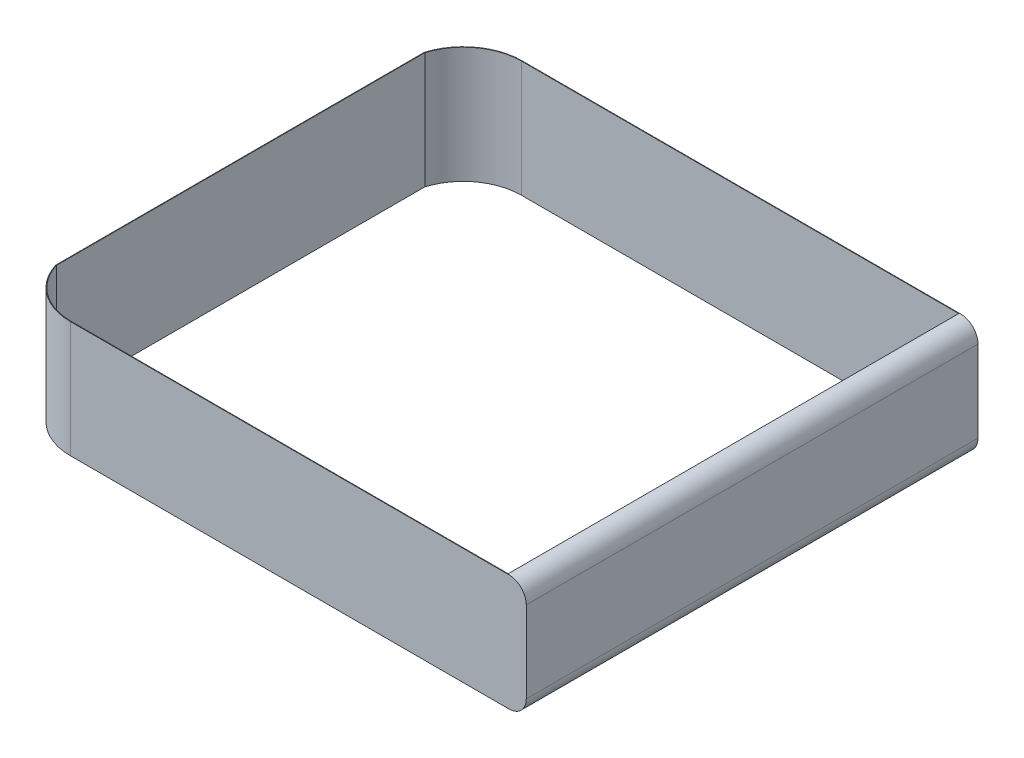
ISO-10303-21;
HEADER;
FILE_DESCRIPTION(('STEP AP214'),'2;1');
FILE_NAME('part.step','',(''),(''),'','','');
FILE_SCHEMA(('AUTOMOTIVE_DESIGN { 1 0 10303 214 1 1 1 1 }'));
ENDSEC;
DATA;
#1=APPLICATION_CONTEXT('core data for automotive mechanical design processes');
#2=APPLICATION_PROTOCOL_DEFINITION('international standard','automotive_design',2000,#1);
#3=PRODUCT_CONTEXT('',#1,'mechanical');
#4=PRODUCT('Part','Part','',(#3));
#5=PRODUCT_RELATED_PRODUCT_CATEGORY('part','',(#4));
#6=PRODUCT_DEFINITION_FORMATION('','',#4);
#7=PRODUCT_DEFINITION_CONTEXT('part definition',#1,'design');
#8=PRODUCT_DEFINITION('design','',#6,#7);
#9=PRODUCT_DEFINITION_SHAPE('','',#8);
#10=(LENGTH_UNIT() NAMED_UNIT(*) SI_UNIT(.MILLI.,.METRE.));
#11=(NAMED_UNIT(*) PLANE_ANGLE_UNIT() SI_UNIT($,.RADIAN.));
#12=(NAMED_UNIT(*) SI_UNIT($,.STERADIAN.) SOLID_ANGLE_UNIT());
#13=UNCERTAINTY_MEASURE_WITH_UNIT(LENGTH_MEASURE(1.E-05),#10,'distance_accuracy_value','');
#14=(GEOMETRIC_REPRESENTATION_CONTEXT(3) GLOBAL_UNCERTAINTY_ASSIGNED_CONTEXT((#13)) GLOBAL_UNIT_ASSIGNED_CONTEXT((#10,
#11,#12)) REPRESENTATION_CONTEXT('',''));
#15=CARTESIAN_POINT('',(0.,0.,0.));
#16=DIRECTION('',(0.,0.,1.));
#17=DIRECTION('',(1.,0.,0.));
#18=AXIS2_PLACEMENT_3D('',#15,#16,#17);
#19=CARTESIAN_POINT('',(8389.70437042069,1976.,1010.));
#20=DIRECTION('',(0.,0.,-1.));
#21=DIRECTION('',(-1.,0.,0.));
#22=AXIS2_PLACEMENT_3D('',#19,#20,#21);
#23=PLANE('',#22);
#24=DIRECTION('',(1.,0.,0.));
#25=VECTOR('',#24,1.);
#26=CARTESIAN_POINT('',(8389.70437042069,0.,1010.));
#27=LINE('',#26,#25);
#28=CARTESIAN_POINT('',(955.264370754283,0.,1010.));
#29=VERTEX_POINT('',#28);
#30=CARTESIAN_POINT('',(8389.70437042069,0.,1010.));
#31=VERTEX_POINT('',#30);
#32=EDGE_CURVE('E146',#29,#31,#27,.T.);
#33=ORIENTED_EDGE('',*,*,#32,.T.);
#34=DIRECTION('',(0.,-1.,0.));
#35=VECTOR('',#34,1.);
#36=CARTESIAN_POINT('',(8389.70437042069,1976.,1010.));
#37=LINE('',#36,#35);
#38=CARTESIAN_POINT('',(8389.70437042069,1976.,1010.));
#39=VERTEX_POINT('',#38);
#40=EDGE_CURVE('E11',#39,#31,#37,.T.);
#41=ORIENTED_EDGE('',*,*,#40,.F.);
#42=DIRECTION('',(1.,0.,0.));
#43=VECTOR('',#42,1.);
#44=CARTESIAN_POINT('',(8389.70437042069,1976.,1010.));
#45=LINE('',#44,#43);
#46=CARTESIAN_POINT('',(955.264370754283,1976.,1010.));
#47=VERTEX_POINT('',#46);
#48=EDGE_CURVE('E176',#47,#39,#45,.T.);
#49=ORIENTED_EDGE('',*,*,#48,.F.);
#50=DIRECTION('',(0.,-1.,0.));
#51=VECTOR('',#50,1.);
#52=CARTESIAN_POINT('',(955.264370754283,1976.,1010.));
#53=LINE('',#52,#51);
#54=EDGE_CURVE('E142',#47,#29,#53,.T.);
#55=ORIENTED_EDGE('',*,*,#54,.T.);
#56=EDGE_LOOP('',(#33,#41,#49,#55));
#57=FACE_BOUND('',#56,.T.);
#58=ADVANCED_FACE('F39',(#57),#23,.F.);
#59=CARTESIAN_POINT('',(8389.70437042069,1976.,1000.));
#60=DIRECTION('',(0.,0.,-1.));
#61=DIRECTION('',(-1.,0.,0.));
#62=AXIS2_PLACEMENT_3D('',#59,#60,#61);
#63=PLANE('',#62);
#64=DIRECTION('',(1.,0.,0.));
#65=VECTOR('',#64,1.);
#66=CARTESIAN_POINT('',(8389.70437042069,0.,1000.));
#67=LINE('',#66,#65);
#68=CARTESIAN_POINT('',(955.264370754283,0.,1000.));
#69=VERTEX_POINT('',#68);
#70=CARTESIAN_POINT('',(8389.70437042069,0.,1000.));
#71=VERTEX_POINT('',#70);
#72=EDGE_CURVE('E153',#69,#71,#67,.T.);
#73=ORIENTED_EDGE('',*,*,#72,.F.);
#74=DIRECTION('',(0.,-1.,0.));
#75=VECTOR('',#74,1.);
#76=CARTESIAN_POINT('',(955.264370754283,1976.,1000.));
#77=LINE('',#76,#75);
#78=CARTESIAN_POINT('',(955.264370754283,1976.,1000.));
#79=VERTEX_POINT('',#78);
#80=EDGE_CURVE('E47',#79,#69,#77,.T.);
#81=ORIENTED_EDGE('',*,*,#80,.F.);
#82=DIRECTION('',(1.,0.,0.));
#83=VECTOR('',#82,1.);
#84=CARTESIAN_POINT('',(8389.70437042069,1976.,1000.));
#85=LINE('',#84,#83);
#86=CARTESIAN_POINT('',(8389.70437042069,1976.,1000.));
#87=VERTEX_POINT('',#86);
#88=EDGE_CURVE('E213',#79,#87,#85,.T.);
#89=ORIENTED_EDGE('',*,*,#88,.T.);
#90=CARTESIAN_POINT('',(8409.85045380316,1679.8671536435,1000.));
#91=DIRECTION('',(0.,0.,-1.));
#92=DIRECTION('',(1.,0.,0.));
#93=AXIS2_PLACEMENT_3D('',#90,#91,#92);
#94=CIRCLE('',#93,296.817329963824);
#95=CARTESIAN_POINT('',(8706.66778376698,1679.8671536435,1000.));
#96=VERTEX_POINT('',#95);
#97=EDGE_CURVE('E292',#87,#96,#94,.T.);
#98=ORIENTED_EDGE('',*,*,#97,.T.);
#99=DIRECTION('',(0.,-1.,0.));
#100=VECTOR('',#99,1.);
#101=CARTESIAN_POINT('',(8706.66778376698,1679.8671536435,1000.));
#102=LINE('',#101,#100);
#103=CARTESIAN_POINT('',(8706.66778376698,296.132846356496,1000.));
#104=VERTEX_POINT('',#103);
#105=EDGE_CURVE('E284',#96,#104,#102,.T.);
#106=ORIENTED_EDGE('',*,*,#105,.T.);
#107=CARTESIAN_POINT('',(8409.85045380316,296.132846356496,1000.));
#108=DIRECTION('',(0.,0.,-1.));
#109=DIRECTION('',(-1.,0.,0.));
#110=AXIS2_PLACEMENT_3D('',#107,#108,#109);
#111=CIRCLE('',#110,296.817329963824);
#112=EDGE_CURVE('E199',#104,#71,#111,.T.);
#113=ORIENTED_EDGE('',*,*,#112,.T.);
#114=EDGE_LOOP('',(#73,#81,#89,#98,#106,#113));
#115=FACE_BOUND('',#114,.T.);
#116=ADVANCED_FACE('F195',(#115),#63,.T.);
#117=CARTESIAN_POINT('',(955.264370754283,1976.,1999.15875841452));
#118=DIRECTION('',(0.,-1.,0.));
#119=DIRECTION('',(0.,0.,-1.));
#120=AXIS2_PLACEMENT_3D('',#117,#118,#119);
#121=CYLINDRICAL_SURFACE('',#120,999.158758414516);
#122=CARTESIAN_POINT('',(955.264370754283,0.,1999.15875841452));
#123=DIRECTION('',(0.,-1.,0.));
#124=DIRECTION('',(0.,0.,1.));
#125=AXIS2_PLACEMENT_3D('',#122,#123,#124);
#126=CIRCLE('',#125,999.158758414516);
#127=CARTESIAN_POINT('',(1.11022302462516E-13,0.,1706.26251998892));
#128=VERTEX_POINT('',#127);
#129=EDGE_CURVE('E156',#128,#69,#126,.T.);
#130=ORIENTED_EDGE('',*,*,#129,.F.);
#131=DIRECTION('',(0.,-1.,0.));
#132=VECTOR('',#131,1.);
#133=CARTESIAN_POINT('',(1.11022302462516E-13,1976.,1706.26251998892));
#134=LINE('',#133,#132);
#135=CARTESIAN_POINT('',(1.11022302462516E-13,1976.,1706.26251998892));
#136=VERTEX_POINT('',#135);
#137=EDGE_CURVE('E187',#136,#128,#134,.T.);
#138=ORIENTED_EDGE('',*,*,#137,.F.);
#139=CARTESIAN_POINT('',(955.264370754283,1976.,1999.15875841452));
#140=DIRECTION('',(0.,-1.,0.));
#141=DIRECTION('',(0.,0.,1.));
#142=AXIS2_PLACEMENT_3D('',#139,#140,#141);
#143=CIRCLE('',#142,999.158758414516);
#144=EDGE_CURVE('E193',#136,#79,#143,.T.);
#145=ORIENTED_EDGE('',*,*,#144,.T.);
#146=ORIENTED_EDGE('',*,*,#80,.T.);
#147=EDGE_LOOP('',(#130,#138,#145,#146));
#148=FACE_BOUND('',#147,.T.);
#149=ADVANCED_FACE('F191',(#148),#121,.T.);
#150=CARTESIAN_POINT('',(0.,1976.,1706.26251998892));
#151=DIRECTION('',(-1.,0.,0.));
#152=DIRECTION('',(0.,0.,1.));
#153=AXIS2_PLACEMENT_3D('',#150,#151,#152);
#154=PLANE('',#153);
#155=DIRECTION('',(0.,0.,-1.));
#156=VECTOR('',#155,1.);
#157=CARTESIAN_POINT('',(0.,0.,1706.26251998892));
#158=LINE('',#157,#156);
#159=CARTESIAN_POINT('',(0.,0.,7973.73748001108));
#160=VERTEX_POINT('',#159);
#161=EDGE_CURVE('E159',#160,#128,#158,.T.);
#162=ORIENTED_EDGE('',*,*,#161,.F.);
#163=DIRECTION('',(0.,-1.,0.));
#164=VECTOR('',#163,1.);
#165=CARTESIAN_POINT('',(0.,1976.,7973.73748001108));
#166=LINE('',#165,#164);
#167=CARTESIAN_POINT('',(0.,1976.,7973.73748001108));
#168=VERTEX_POINT('',#167);
#169=EDGE_CURVE('E185',#168,#160,#166,.T.);
#170=ORIENTED_EDGE('',*,*,#169,.F.);
#171=DIRECTION('',(0.,0.,-1.));
#172=VECTOR('',#171,1.);
#173=CARTESIAN_POINT('',(0.,1976.,1706.26251998892));
#174=LINE('',#173,#172);
#175=EDGE_CURVE('E209',#168,#136,#174,.T.);
#176=ORIENTED_EDGE('',*,*,#175,.T.);
#177=ORIENTED_EDGE('',*,*,#137,.T.);
#178=EDGE_LOOP('',(#162,#170,#176,#177));
#179=FACE_BOUND('',#178,.T.);
#180=ADVANCED_FACE('F206',(#179),#154,.T.);
#181=CARTESIAN_POINT('',(955.264370754283,1976.,7680.84124158548));
#182=DIRECTION('',(0.,-1.,0.));
#183=DIRECTION('',(0.,0.,-1.));
#184=AXIS2_PLACEMENT_3D('',#181,#182,#183);
#185=CYLINDRICAL_SURFACE('',#184,999.158758414517);
#186=CARTESIAN_POINT('',(955.264370754283,0.,7680.84124158548));
#187=DIRECTION('',(0.,-1.,0.));
#188=DIRECTION('',(0.,0.,-1.));
#189=AXIS2_PLACEMENT_3D('',#186,#187,#188);
#190=CIRCLE('',#189,999.158758414517);
#191=CARTESIAN_POINT('',(955.264370754283,0.,8680.));
#192=VERTEX_POINT('',#191);
#193=EDGE_CURVE('E162',#192,#160,#190,.T.);
#194=ORIENTED_EDGE('',*,*,#193,.F.);
#195=DIRECTION('',(0.,-1.,0.));
#196=VECTOR('',#195,1.);
#197=CARTESIAN_POINT('',(955.264370754283,1976.,8680.));
#198=LINE('',#197,#196);
#199=CARTESIAN_POINT('',(955.264370754283,1976.,8680.));
#200=VERTEX_POINT('',#199);
#201=EDGE_CURVE('E183',#200,#192,#198,.T.);
#202=ORIENTED_EDGE('',*,*,#201,.F.);
#203=CARTESIAN_POINT('',(955.264370754283,1976.,7680.84124158548));
#204=DIRECTION('',(0.,-1.,0.));
#205=DIRECTION('',(0.,0.,-1.));
#206=AXIS2_PLACEMENT_3D('',#203,#204,#205);
#207=CIRCLE('',#206,999.158758414517);
#208=EDGE_CURVE('E215',#200,#168,#207,.T.);
#209=ORIENTED_EDGE('',*,*,#208,.T.);
#210=ORIENTED_EDGE('',*,*,#169,.T.);
#211=EDGE_LOOP('',(#194,#202,#209,#210));
#212=FACE_BOUND('',#211,.T.);
#213=ADVANCED_FACE('F253',(#212),#185,.T.);
#214=CARTESIAN_POINT('',(8389.70437042069,1976.,8680.));
#215=DIRECTION('',(0.,0.,1.));
#216=DIRECTION('',(1.,0.,0.));
#217=AXIS2_PLACEMENT_3D('',#214,#215,#216);
#218=PLANE('',#217);
#219=DIRECTION('',(-1.,0.,0.));
#220=VECTOR('',#219,1.);
#221=CARTESIAN_POINT('',(8389.70437042069,0.,8680.));
#222=LINE('',#221,#220);
#223=CARTESIAN_POINT('',(8389.70437042069,0.,8680.));
#224=VERTEX_POINT('',#223);
#225=EDGE_CURVE('E165',#224,#192,#222,.T.);
#226=ORIENTED_EDGE('',*,*,#225,.F.);
#227=CARTESIAN_POINT('',(8409.85045380316,296.132846356496,8680.));
#228=DIRECTION('',(0.,0.,-1.));
#229=DIRECTION('',(-1.,0.,0.));
#230=AXIS2_PLACEMENT_3D('',#227,#228,#229);
#231=CIRCLE('',#230,296.817329963824);
#232=CARTESIAN_POINT('',(8706.66778376698,296.132846356496,8680.));
#233=VERTEX_POINT('',#232);
#234=EDGE_CURVE('E254',#233,#224,#231,.T.);
#235=ORIENTED_EDGE('',*,*,#234,.F.);
#236=DIRECTION('',(0.,-1.,0.));
#237=VECTOR('',#236,1.);
#238=CARTESIAN_POINT('',(8706.66778376698,1679.8671536435,8680.));
#239=LINE('',#238,#237);
#240=CARTESIAN_POINT('',(8706.66778376698,1679.8671536435,8680.));
#241=VERTEX_POINT('',#240);
#242=EDGE_CURVE('E250',#241,#233,#239,.T.);
#243=ORIENTED_EDGE('',*,*,#242,.F.);
#244=CARTESIAN_POINT('',(8409.85045380316,1679.8671536435,8680.));
#245=DIRECTION('',(0.,0.,-1.));
#246=DIRECTION('',(1.,0.,0.));
#247=AXIS2_PLACEMENT_3D('',#244,#245,#246);
#248=CIRCLE('',#247,296.817329963824);
#249=CARTESIAN_POINT('',(8389.70437042069,1976.,8680.));
#250=VERTEX_POINT('',#249);
#251=EDGE_CURVE('E236',#250,#241,#248,.T.);
#252=ORIENTED_EDGE('',*,*,#251,.F.);
#253=DIRECTION('',(-1.,0.,0.));
#254=VECTOR('',#253,1.);
#255=CARTESIAN_POINT('',(8389.70437042069,1976.,8680.));
#256=LINE('',#255,#254);
#257=EDGE_CURVE('E222',#250,#200,#256,.T.);
#258=ORIENTED_EDGE('',*,*,#257,.T.);
#259=ORIENTED_EDGE('',*,*,#201,.T.);
#260=EDGE_LOOP('',(#226,#235,#243,#252,#258,#259));
#261=FACE_BOUND('',#260,.T.);
#262=ADVANCED_FACE('F247',(#261),#218,.T.);
#263=CARTESIAN_POINT('',(8389.70437042069,1976.,8670.));
#264=DIRECTION('',(0.,0.,1.));
#265=DIRECTION('',(1.,0.,0.));
#266=AXIS2_PLACEMENT_3D('',#263,#264,#265);
#267=PLANE('',#266);
#268=DIRECTION('',(1.,0.,0.));
#269=VECTOR('',#268,1.);
#270=CARTESIAN_POINT('',(8389.70437042069,0.,8670.));
#271=LINE('',#270,#269);
#272=CARTESIAN_POINT('',(8389.70437042069,0.,8670.));
#273=VERTEX_POINT('',#272);
#274=CARTESIAN_POINT('',(955.264370754283,0.,8670.));
#275=VERTEX_POINT('',#274);
#276=EDGE_CURVE('E171',#273,#275,#271,.F.);
#277=ORIENTED_EDGE('',*,*,#276,.T.);
#278=DIRECTION('',(0.,-1.,0.));
#279=VECTOR('',#278,1.);
#280=CARTESIAN_POINT('',(955.264370754283,1976.,8670.));
#281=LINE('',#280,#279);
#282=CARTESIAN_POINT('',(955.264370754283,1976.,8670.));
#283=VERTEX_POINT('',#282);
#284=EDGE_CURVE('E137',#283,#275,#281,.T.);
#285=ORIENTED_EDGE('',*,*,#284,.F.);
#286=DIRECTION('',(1.,0.,0.));
#287=VECTOR('',#286,1.);
#288=CARTESIAN_POINT('',(8389.70437042069,1976.,8670.));
#289=LINE('',#288,#287);
#290=CARTESIAN_POINT('',(8389.70437042069,1976.,8670.));
#291=VERTEX_POINT('',#290);
#292=EDGE_CURVE('E128',#291,#283,#289,.F.);
#293=ORIENTED_EDGE('',*,*,#292,.F.);
#294=DIRECTION('',(0.,-1.,0.));
#295=VECTOR('',#294,1.);
#296=CARTESIAN_POINT('',(8389.70437042069,1976.,8670.));
#297=LINE('',#296,#295);
#298=EDGE_CURVE('E180',#291,#273,#297,.T.);
#299=ORIENTED_EDGE('',*,*,#298,.T.);
#300=EDGE_LOOP('',(#277,#285,#293,#299));
#301=FACE_BOUND('',#300,.T.);
#302=ADVANCED_FACE('F266',(#301),#267,.F.);
#303=CARTESIAN_POINT('',(955.264370754283,1976.,7680.84124158548));
#304=DIRECTION('',(0.,-1.,0.));
#305=DIRECTION('',(0.,0.,-1.));
#306=AXIS2_PLACEMENT_3D('',#303,#304,#305);
#307=CYLINDRICAL_SURFACE('',#306,989.158758414516);
#308=CARTESIAN_POINT('',(955.264370754283,0.,7680.84124158548));
#309=DIRECTION('',(0.,1.,0.));
#310=DIRECTION('',(1.,0.,0.));
#311=AXIS2_PLACEMENT_3D('',#308,#309,#310);
#312=CIRCLE('',#311,989.158758414516);
#313=CARTESIAN_POINT('',(10.,0.,7972.23499363013));
#314=VERTEX_POINT('',#313);
#315=EDGE_CURVE('E136',#275,#314,#312,.F.);
#316=ORIENTED_EDGE('',*,*,#315,.T.);
#317=DIRECTION('',(0.,-1.,0.));
#318=VECTOR('',#317,1.);
#319=CARTESIAN_POINT('',(10.,1976.,7972.23499363013));
#320=LINE('',#319,#318);
#321=CARTESIAN_POINT('',(10.,1976.,7972.23499363013));
#322=VERTEX_POINT('',#321);
#323=EDGE_CURVE('E133',#322,#314,#320,.T.);
#324=ORIENTED_EDGE('',*,*,#323,.F.);
#325=CARTESIAN_POINT('',(955.264370754283,1976.,7680.84124158548));
#326=DIRECTION('',(0.,1.,0.));
#327=DIRECTION('',(1.,0.,0.));
#328=AXIS2_PLACEMENT_3D('',#325,#326,#327);
#329=CIRCLE('',#328,989.158758414516);
#330=EDGE_CURVE('E121',#283,#322,#329,.F.);
#331=ORIENTED_EDGE('',*,*,#330,.F.);
#332=ORIENTED_EDGE('',*,*,#284,.T.);
#333=EDGE_LOOP('',(#316,#324,#331,#332));
#334=FACE_BOUND('',#333,.T.);
#335=ADVANCED_FACE('F134',(#334),#307,.F.);
#336=CARTESIAN_POINT('',(10.,1976.,1706.26251998892));
#337=DIRECTION('',(-1.,0.,0.));
#338=DIRECTION('',(0.,0.,1.));
#339=AXIS2_PLACEMENT_3D('',#336,#337,#338);
#340=PLANE('',#339);
#341=DIRECTION('',(0.,0.,-1.));
#342=VECTOR('',#341,1.);
#343=CARTESIAN_POINT('',(10.,0.,1706.26251998892));
#344=LINE('',#343,#342);
#345=CARTESIAN_POINT('',(10.,0.,1707.76500636987));
#346=VERTEX_POINT('',#345);
#347=EDGE_CURVE('E91',#314,#346,#344,.T.);
#348=ORIENTED_EDGE('',*,*,#347,.T.);
#349=DIRECTION('',(0.,-1.,0.));
#350=VECTOR('',#349,1.);
#351=CARTESIAN_POINT('',(10.,1976.,1707.76500636987));
#352=LINE('',#351,#350);
#353=CARTESIAN_POINT('',(10.,1976.,1707.76500636987));
#354=VERTEX_POINT('',#353);
#355=EDGE_CURVE('E138',#354,#346,#352,.T.);
#356=ORIENTED_EDGE('',*,*,#355,.F.);
#357=DIRECTION('',(0.,0.,-1.));
#358=VECTOR('',#357,1.);
#359=CARTESIAN_POINT('',(10.,1976.,1706.26251998892));
#360=LINE('',#359,#358);
#361=EDGE_CURVE('E125',#322,#354,#360,.T.);
#362=ORIENTED_EDGE('',*,*,#361,.F.);
#363=ORIENTED_EDGE('',*,*,#323,.T.);
#364=EDGE_LOOP('',(#348,#356,#362,#363));
#365=FACE_BOUND('',#364,.T.);
#366=ADVANCED_FACE('F140',(#365),#340,.F.);
#367=CARTESIAN_POINT('',(955.264370754283,1976.,1999.15875841452));
#368=DIRECTION('',(0.,-1.,0.));
#369=DIRECTION('',(0.,0.,-1.));
#370=AXIS2_PLACEMENT_3D('',#367,#368,#369);
#371=CYLINDRICAL_SURFACE('',#370,989.158758414516);
#372=CARTESIAN_POINT('',(955.264370754283,0.,1999.15875841452));
#373=DIRECTION('',(0.,1.,0.));
#374=DIRECTION('',(1.,0.,0.));
#375=AXIS2_PLACEMENT_3D('',#372,#373,#374);
#376=CIRCLE('',#375,989.158758414516);
#377=EDGE_CURVE('E97',#346,#29,#376,.F.);
#378=ORIENTED_EDGE('',*,*,#377,.T.);
#379=ORIENTED_EDGE('',*,*,#54,.F.);
#380=CARTESIAN_POINT('',(955.264370754283,1976.,1999.15875841452));
#381=DIRECTION('',(0.,1.,0.));
#382=DIRECTION('',(1.,0.,0.));
#383=AXIS2_PLACEMENT_3D('',#380,#381,#382);
#384=CIRCLE('',#383,989.158758414516);
#385=EDGE_CURVE('E55',#354,#47,#384,.F.);
#386=ORIENTED_EDGE('',*,*,#385,.F.);
#387=ORIENTED_EDGE('',*,*,#355,.T.);
#388=EDGE_LOOP('',(#378,#379,#386,#387));
#389=FACE_BOUND('',#388,.T.);
#390=ADVANCED_FACE('F301',(#389),#371,.F.);
#391=CARTESIAN_POINT('',(955.264370754283,1976.,1999.15875841452));
#392=DIRECTION('',(0.,-1.,0.));
#393=DIRECTION('',(-1.,0.,0.));
#394=AXIS2_PLACEMENT_3D('',#391,#392,#393);
#395=PLANE('',#394);
#396=ORIENTED_EDGE('',*,*,#48,.T.);
#397=DIRECTION('',(0.,0.,1.));
#398=VECTOR('',#397,1.);
#399=CARTESIAN_POINT('',(8389.70437042069,1976.,1000.));
#400=LINE('',#399,#398);
#401=EDGE_CURVE('E217',#87,#39,#400,.T.);
#402=ORIENTED_EDGE('',*,*,#401,.F.);
#403=ORIENTED_EDGE('',*,*,#88,.F.);
#404=ORIENTED_EDGE('',*,*,#144,.F.);
#405=ORIENTED_EDGE('',*,*,#175,.F.);
#406=ORIENTED_EDGE('',*,*,#208,.F.);
#407=ORIENTED_EDGE('',*,*,#257,.F.);
#408=DIRECTION('',(0.,0.,1.));
#409=VECTOR('',#408,1.);
#410=CARTESIAN_POINT('',(8389.70437042069,1976.,8670.));
#411=LINE('',#410,#409);
#412=EDGE_CURVE('E225',#291,#250,#411,.T.);
#413=ORIENTED_EDGE('',*,*,#412,.F.);
#414=ORIENTED_EDGE('',*,*,#292,.T.);
#415=ORIENTED_EDGE('',*,*,#330,.T.);
#416=ORIENTED_EDGE('',*,*,#361,.T.);
#417=ORIENTED_EDGE('',*,*,#385,.T.);
#418=EDGE_LOOP('',(#396,#402,#403,#404,#405,#406,#407,#413,#414,#415,#416,#417));
#419=FACE_BOUND('',#418,.T.);
#420=ADVANCED_FACE('F123',(#419),#395,.F.);
#421=CARTESIAN_POINT('',(955.264370754283,0.,1999.15875841452));
#422=DIRECTION('',(0.,-1.,0.));
#423=DIRECTION('',(-1.,0.,0.));
#424=AXIS2_PLACEMENT_3D('',#421,#422,#423);
#425=PLANE('',#424);
#426=ORIENTED_EDGE('',*,*,#32,.F.);
#427=ORIENTED_EDGE('',*,*,#377,.F.);
#428=ORIENTED_EDGE('',*,*,#347,.F.);
#429=ORIENTED_EDGE('',*,*,#315,.F.);
#430=ORIENTED_EDGE('',*,*,#276,.F.);
#431=DIRECTION('',(0.,0.,1.));
#432=VECTOR('',#431,1.);
#433=CARTESIAN_POINT('',(8389.70437042069,0.,8670.));
#434=LINE('',#433,#432);
#435=EDGE_CURVE('E168',#273,#224,#434,.T.);
#436=ORIENTED_EDGE('',*,*,#435,.T.);
#437=ORIENTED_EDGE('',*,*,#225,.T.);
#438=ORIENTED_EDGE('',*,*,#193,.T.);
#439=ORIENTED_EDGE('',*,*,#161,.T.);
#440=ORIENTED_EDGE('',*,*,#129,.T.);
#441=ORIENTED_EDGE('',*,*,#72,.T.);
#442=DIRECTION('',(0.,0.,1.));
#443=VECTOR('',#442,1.);
#444=CARTESIAN_POINT('',(8389.70437042069,0.,1000.));
#445=LINE('',#444,#443);
#446=EDGE_CURVE('E149',#71,#31,#445,.T.);
#447=ORIENTED_EDGE('',*,*,#446,.T.);
#448=EDGE_LOOP('',(#426,#427,#428,#429,#430,#436,#437,#438,#439,#440,#441,#447));
#449=FACE_BOUND('',#448,.T.);
#450=ADVANCED_FACE('F202',(#449),#425,.T.);
#451=CARTESIAN_POINT('',(8389.70437042069,0.,8680.));
#452=DIRECTION('',(-1.,0.,0.));
#453=DIRECTION('',(0.,0.,1.));
#454=AXIS2_PLACEMENT_3D('',#451,#452,#453);
#455=PLANE('',#454);
#456=ORIENTED_EDGE('',*,*,#40,.T.);
#457=DIRECTION('',(0.,0.,-1.));
#458=VECTOR('',#457,1.);
#459=CARTESIAN_POINT('',(8389.70437042069,0.,8680.));
#460=LINE('',#459,#458);
#461=EDGE_CURVE('E261',#273,#31,#460,.T.);
#462=ORIENTED_EDGE('',*,*,#461,.F.);
#463=ORIENTED_EDGE('',*,*,#298,.F.);
#464=DIRECTION('',(0.,0.,-1.));
#465=VECTOR('',#464,1.);
#466=CARTESIAN_POINT('',(8389.70437042069,1976.,8680.));
#467=LINE('',#466,#465);
#468=EDGE_CURVE('E150',#291,#39,#467,.T.);
#469=ORIENTED_EDGE('',*,*,#468,.T.);
#470=EDGE_LOOP('',(#456,#462,#463,#469));
#471=FACE_BOUND('',#470,.T.);
#472=ADVANCED_FACE('F268',(#471),#455,.T.);
#473=CARTESIAN_POINT('',(8409.85045380316,1679.8671536435,8680.));
#474=DIRECTION('',(0.,0.,-1.));
#475=DIRECTION('',(-1.,0.,0.));
#476=AXIS2_PLACEMENT_3D('',#473,#474,#475);
#477=CYLINDRICAL_SURFACE('',#476,296.817329963824);
#478=ORIENTED_EDGE('',*,*,#97,.F.);
#479=ORIENTED_EDGE('',*,*,#401,.T.);
#480=ORIENTED_EDGE('',*,*,#468,.F.);
#481=ORIENTED_EDGE('',*,*,#412,.T.);
#482=ORIENTED_EDGE('',*,*,#251,.T.);
#483=DIRECTION('',(0.,0.,-1.));
#484=VECTOR('',#483,1.);
#485=CARTESIAN_POINT('',(8706.66778376698,1679.8671536435,8680.));
#486=LINE('',#485,#484);
#487=EDGE_CURVE('E282',#241,#96,#486,.T.);
#488=ORIENTED_EDGE('',*,*,#487,.T.);
#489=EDGE_LOOP('',(#478,#479,#480,#481,#482,#488));
#490=FACE_BOUND('',#489,.T.);
#491=ADVANCED_FACE('F233',(#490),#477,.T.);
#492=CARTESIAN_POINT('',(8409.85045380316,296.132846356496,8680.));
#493=DIRECTION('',(0.,0.,-1.));
#494=DIRECTION('',(-1.,0.,0.));
#495=AXIS2_PLACEMENT_3D('',#492,#493,#494);
#496=CYLINDRICAL_SURFACE('',#495,296.817329963824);
#497=ORIENTED_EDGE('',*,*,#112,.F.);
#498=DIRECTION('',(0.,0.,-1.));
#499=VECTOR('',#498,1.);
#500=CARTESIAN_POINT('',(8706.66778376698,296.132846356496,8680.));
#501=LINE('',#500,#499);
#502=EDGE_CURVE('E286',#233,#104,#501,.T.);
#503=ORIENTED_EDGE('',*,*,#502,.F.);
#504=ORIENTED_EDGE('',*,*,#234,.T.);
#505=ORIENTED_EDGE('',*,*,#435,.F.);
#506=ORIENTED_EDGE('',*,*,#461,.T.);
#507=ORIENTED_EDGE('',*,*,#446,.F.);
#508=EDGE_LOOP('',(#497,#503,#504,#505,#506,#507));
#509=FACE_BOUND('',#508,.T.);
#510=ADVANCED_FACE('F258',(#509),#496,.T.);
#511=CARTESIAN_POINT('',(8706.66778376698,1679.8671536435,8680.));
#512=DIRECTION('',(1.,0.,0.));
#513=DIRECTION('',(0.,0.,-1.));
#514=AXIS2_PLACEMENT_3D('',#511,#512,#513);
#515=PLANE('',#514);
#516=ORIENTED_EDGE('',*,*,#105,.F.);
#517=ORIENTED_EDGE('',*,*,#487,.F.);
#518=ORIENTED_EDGE('',*,*,#242,.T.);
#519=ORIENTED_EDGE('',*,*,#502,.T.);
#520=EDGE_LOOP('',(#516,#517,#518,#519));
#521=FACE_BOUND('',#520,.T.);
#522=ADVANCED_FACE('F283',(#521),#515,.T.);
#523=CLOSED_SHELL('',(#58,#116,#149,#180,#213,#262,#302,#335,#366,#390,#420,#450,#472,#491,#510,#522));
#524=MANIFOLD_SOLID_BREP('B2',#523);
#525=ADVANCED_BREP_SHAPE_REPRESENTATION('',(#18,#524),#14);
#526=SHAPE_DEFINITION_REPRESENTATION(#9,#525);
ENDSEC;
END-ISO-10303-21;
